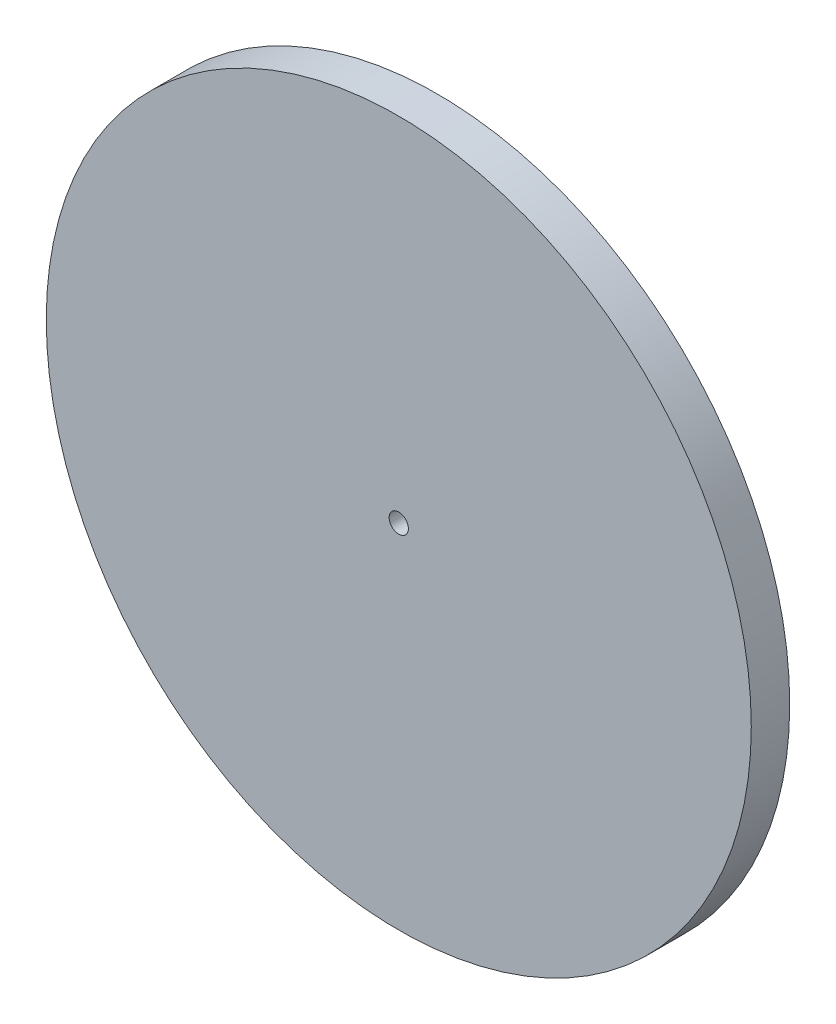
ISO-10303-21;
HEADER;
FILE_DESCRIPTION(('STEP AP214'),'2;1');
FILE_NAME('part.step','',(''),(''),'','','');
FILE_SCHEMA(('AUTOMOTIVE_DESIGN { 1 0 10303 214 1 1 1 1 }'));
ENDSEC;
DATA;
#1=APPLICATION_CONTEXT('core data for automotive mechanical design processes');
#2=APPLICATION_PROTOCOL_DEFINITION('international standard','automotive_design',2000,#1);
#3=PRODUCT_CONTEXT('',#1,'mechanical');
#4=PRODUCT('Part','Part','',(#3));
#5=PRODUCT_RELATED_PRODUCT_CATEGORY('part','',(#4));
#6=PRODUCT_DEFINITION_FORMATION('','',#4);
#7=PRODUCT_DEFINITION_CONTEXT('part definition',#1,'design');
#8=PRODUCT_DEFINITION('design','',#6,#7);
#9=PRODUCT_DEFINITION_SHAPE('','',#8);
#10=(LENGTH_UNIT() NAMED_UNIT(*) SI_UNIT(.MILLI.,.METRE.));
#11=(NAMED_UNIT(*) PLANE_ANGLE_UNIT() SI_UNIT($,.RADIAN.));
#12=(NAMED_UNIT(*) SI_UNIT($,.STERADIAN.) SOLID_ANGLE_UNIT());
#13=UNCERTAINTY_MEASURE_WITH_UNIT(LENGTH_MEASURE(1.E-05),#10,'distance_accuracy_value','');
#14=(GEOMETRIC_REPRESENTATION_CONTEXT(3) GLOBAL_UNCERTAINTY_ASSIGNED_CONTEXT((#13)) GLOBAL_UNIT_ASSIGNED_CONTEXT((#10,
#11,#12)) REPRESENTATION_CONTEXT('',''));
#15=CARTESIAN_POINT('',(0.,0.,0.));
#16=DIRECTION('',(0.,0.,1.));
#17=DIRECTION('',(1.,0.,0.));
#18=AXIS2_PLACEMENT_3D('',#15,#16,#17);
#19=CARTESIAN_POINT('',(0.,0.,3.));
#20=DIRECTION('',(0.,0.,1.));
#21=DIRECTION('',(1.,0.,0.));
#22=AXIS2_PLACEMENT_3D('',#19,#20,#21);
#23=PLANE('',#22);
#24=CARTESIAN_POINT('',(0.,0.,3.));
#25=DIRECTION('',(0.,0.,1.));
#26=DIRECTION('',(1.,0.,0.));
#27=AXIS2_PLACEMENT_3D('',#24,#25,#26);
#28=CIRCLE('',#27,27.5);
#29=CARTESIAN_POINT('',(27.5,0.,3.));
#30=VERTEX_POINT('',#29);
#31=EDGE_CURVE('E10',#30,#30,#28,.T.);
#32=ORIENTED_EDGE('',*,*,#31,.T.);
#33=EDGE_LOOP('',(#32));
#34=FACE_BOUND('',#33,.T.);
#35=CARTESIAN_POINT('',(0.,0.,3.));
#36=DIRECTION('',(0.,0.,1.));
#37=DIRECTION('',(1.,0.,0.));
#38=AXIS2_PLACEMENT_3D('',#35,#36,#37);
#39=CIRCLE('',#38,0.75);
#40=CARTESIAN_POINT('',(0.75,0.,3.));
#41=VERTEX_POINT('',#40);
#42=EDGE_CURVE('E43',#41,#41,#39,.T.);
#43=ORIENTED_EDGE('',*,*,#42,.F.);
#44=EDGE_LOOP('',(#43));
#45=FACE_BOUND('',#44,.T.);
#46=ADVANCED_FACE('F32',(#34,#45),#23,.T.);
#47=CARTESIAN_POINT('',(0.,0.,0.));
#48=DIRECTION('',(0.,0.,1.));
#49=DIRECTION('',(1.,0.,0.));
#50=AXIS2_PLACEMENT_3D('',#47,#48,#49);
#51=PLANE('',#50);
#52=CARTESIAN_POINT('',(0.,0.,0.));
#53=DIRECTION('',(0.,0.,1.));
#54=DIRECTION('',(1.,0.,0.));
#55=AXIS2_PLACEMENT_3D('',#52,#53,#54);
#56=CIRCLE('',#55,27.5);
#57=CARTESIAN_POINT('',(27.5,0.,0.));
#58=VERTEX_POINT('',#57);
#59=EDGE_CURVE('E36',#58,#58,#56,.T.);
#60=ORIENTED_EDGE('',*,*,#59,.F.);
#61=EDGE_LOOP('',(#60));
#62=FACE_BOUND('',#61,.T.);
#63=CARTESIAN_POINT('',(0.,0.,0.));
#64=DIRECTION('',(0.,0.,1.));
#65=DIRECTION('',(1.,0.,0.));
#66=AXIS2_PLACEMENT_3D('',#63,#64,#65);
#67=CIRCLE('',#66,0.75);
#68=CARTESIAN_POINT('',(0.75,0.,0.));
#69=VERTEX_POINT('',#68);
#70=EDGE_CURVE('E45',#69,#69,#67,.T.);
#71=ORIENTED_EDGE('',*,*,#70,.T.);
#72=EDGE_LOOP('',(#71));
#73=FACE_BOUND('',#72,.T.);
#74=ADVANCED_FACE('F55',(#62,#73),#51,.F.);
#75=CARTESIAN_POINT('',(0.,0.,3.));
#76=DIRECTION('',(0.,0.,-1.));
#77=DIRECTION('',(-1.,0.,0.));
#78=AXIS2_PLACEMENT_3D('',#75,#76,#77);
#79=CYLINDRICAL_SURFACE('',#78,27.5);
#80=ORIENTED_EDGE('',*,*,#31,.F.);
#81=EDGE_LOOP('',(#80));
#82=FACE_BOUND('',#81,.T.);
#83=ORIENTED_EDGE('',*,*,#59,.T.);
#84=EDGE_LOOP('',(#83));
#85=FACE_BOUND('',#84,.T.);
#86=ADVANCED_FACE('F34',(#82,#85),#79,.T.);
#87=CARTESIAN_POINT('',(0.,0.,3.));
#88=DIRECTION('',(0.,0.,-1.));
#89=DIRECTION('',(-1.,0.,0.));
#90=AXIS2_PLACEMENT_3D('',#87,#88,#89);
#91=CYLINDRICAL_SURFACE('',#90,0.75);
#92=ORIENTED_EDGE('',*,*,#42,.T.);
#93=EDGE_LOOP('',(#92));
#94=FACE_BOUND('',#93,.T.);
#95=ORIENTED_EDGE('',*,*,#70,.F.);
#96=EDGE_LOOP('',(#95));
#97=FACE_BOUND('',#96,.T.);
#98=ADVANCED_FACE('F51',(#94,#97),#91,.F.);
#99=CLOSED_SHELL('',(#46,#74,#86,#98));
#100=MANIFOLD_SOLID_BREP('B2',#99);
#101=ADVANCED_BREP_SHAPE_REPRESENTATION('',(#18,#100),#14);
#102=SHAPE_DEFINITION_REPRESENTATION(#9,#101);
ENDSEC;
END-ISO-10303-21;
